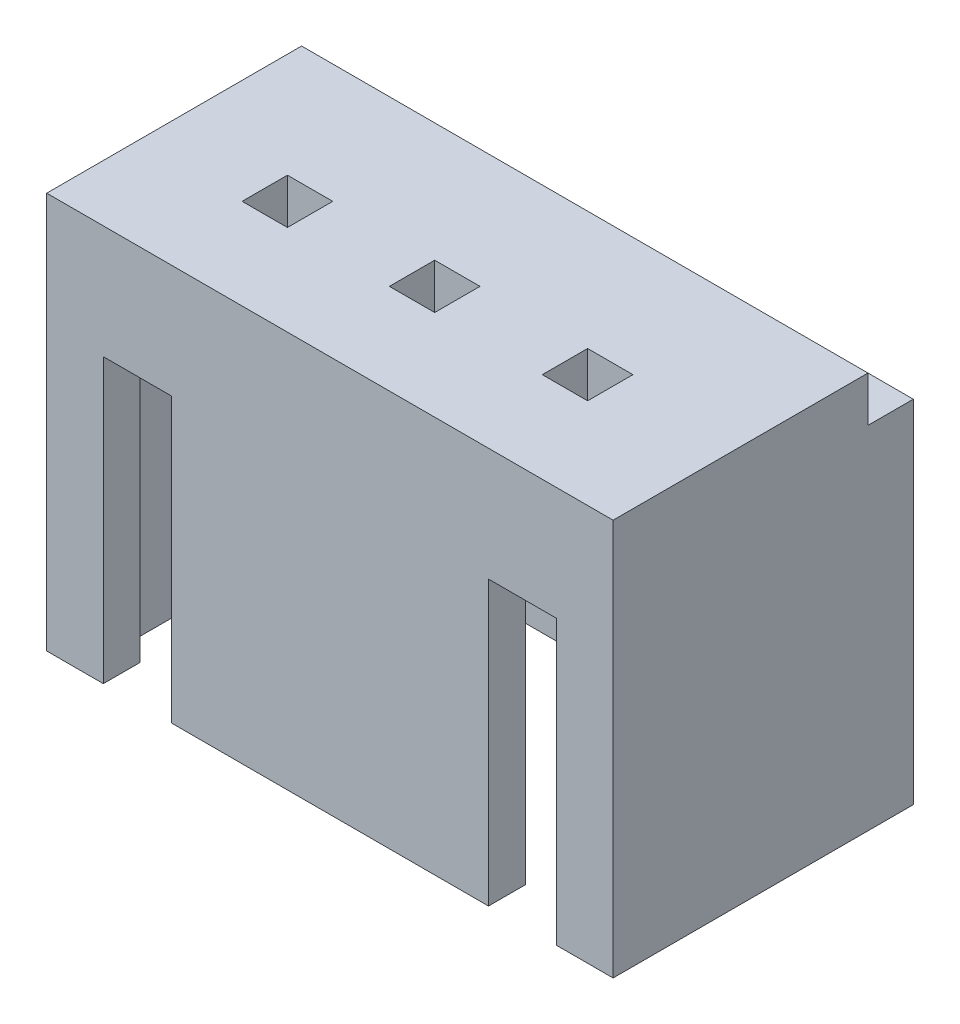
ISO-10303-21;
HEADER;
FILE_DESCRIPTION(('STEP AP214'),'2;1');
FILE_NAME('part.step','',(''),(''),'','','');
FILE_SCHEMA(('AUTOMOTIVE_DESIGN { 1 0 10303 214 1 1 1 1 }'));
ENDSEC;
DATA;
#1=APPLICATION_CONTEXT('core data for automotive mechanical design processes');
#2=APPLICATION_PROTOCOL_DEFINITION('international standard','automotive_design',2000,#1);
#3=PRODUCT_CONTEXT('',#1,'mechanical');
#4=PRODUCT('Part','Part','',(#3));
#5=PRODUCT_RELATED_PRODUCT_CATEGORY('part','',(#4));
#6=PRODUCT_DEFINITION_FORMATION('','',#4);
#7=PRODUCT_DEFINITION_CONTEXT('part definition',#1,'design');
#8=PRODUCT_DEFINITION('design','',#6,#7);
#9=PRODUCT_DEFINITION_SHAPE('','',#8);
#10=(LENGTH_UNIT() NAMED_UNIT(*) SI_UNIT(.MILLI.,.METRE.));
#11=(NAMED_UNIT(*) PLANE_ANGLE_UNIT() SI_UNIT($,.RADIAN.));
#12=(NAMED_UNIT(*) SI_UNIT($,.STERADIAN.) SOLID_ANGLE_UNIT());
#13=UNCERTAINTY_MEASURE_WITH_UNIT(LENGTH_MEASURE(1.E-05),#10,'distance_accuracy_value','');
#14=(GEOMETRIC_REPRESENTATION_CONTEXT(3) GLOBAL_UNCERTAINTY_ASSIGNED_CONTEXT((#13)) GLOBAL_UNIT_ASSIGNED_CONTEXT((#10,
#11,#12)) REPRESENTATION_CONTEXT('',''));
#15=CARTESIAN_POINT('',(0.,0.,0.));
#16=DIRECTION('',(0.,0.,1.));
#17=DIRECTION('',(1.,0.,0.));
#18=AXIS2_PLACEMENT_3D('',#15,#16,#17);
#19=CARTESIAN_POINT('',(5.,7.,2.65));
#20=DIRECTION('',(-1.,0.,0.));
#21=DIRECTION('',(0.,0.,1.));
#22=AXIS2_PLACEMENT_3D('',#19,#20,#21);
#23=PLANE('',#22);
#24=DIRECTION('',(0.,1.,0.));
#25=VECTOR('',#24,1.);
#26=CARTESIAN_POINT('',(5.,6.2,-1.85));
#27=LINE('',#26,#25);
#28=CARTESIAN_POINT('',(5.,6.2,-1.85));
#29=VERTEX_POINT('',#28);
#30=CARTESIAN_POINT('',(5.,7.,-1.85));
#31=VERTEX_POINT('',#30);
#32=EDGE_CURVE('E348',#29,#31,#27,.T.);
#33=ORIENTED_EDGE('',*,*,#32,.T.);
#34=DIRECTION('',(0.,0.,-1.));
#35=VECTOR('',#34,1.);
#36=CARTESIAN_POINT('',(5.,7.,2.65));
#37=LINE('',#36,#35);
#38=CARTESIAN_POINT('',(5.,7.,2.65));
#39=VERTEX_POINT('',#38);
#40=EDGE_CURVE('E424',#39,#31,#37,.T.);
#41=ORIENTED_EDGE('',*,*,#40,.F.);
#42=DIRECTION('',(0.,-1.,0.));
#43=VECTOR('',#42,1.);
#44=CARTESIAN_POINT('',(5.,7.,2.65));
#45=LINE('',#44,#43);
#46=CARTESIAN_POINT('',(5.,0.,2.65));
#47=VERTEX_POINT('',#46);
#48=EDGE_CURVE('E432',#39,#47,#45,.T.);
#49=ORIENTED_EDGE('',*,*,#48,.T.);
#50=DIRECTION('',(0.,0.,-1.));
#51=VECTOR('',#50,1.);
#52=CARTESIAN_POINT('',(5.,0.,2.65));
#53=LINE('',#52,#51);
#54=CARTESIAN_POINT('',(5.,0.,-2.65));
#55=VERTEX_POINT('',#54);
#56=EDGE_CURVE('E419',#47,#55,#53,.T.);
#57=ORIENTED_EDGE('',*,*,#56,.T.);
#58=DIRECTION('',(0.,-1.,0.));
#59=VECTOR('',#58,1.);
#60=CARTESIAN_POINT('',(5.,7.,-2.65));
#61=LINE('',#60,#59);
#62=CARTESIAN_POINT('',(5.,6.2,-2.65));
#63=VERTEX_POINT('',#62);
#64=EDGE_CURVE('E451',#63,#55,#61,.T.);
#65=ORIENTED_EDGE('',*,*,#64,.F.);
#66=DIRECTION('',(0.,0.,-1.));
#67=VECTOR('',#66,1.);
#68=CARTESIAN_POINT('',(5.,6.2,-1.85));
#69=LINE('',#68,#67);
#70=EDGE_CURVE('E336',#29,#63,#69,.T.);
#71=ORIENTED_EDGE('',*,*,#70,.F.);
#72=EDGE_LOOP('',(#33,#41,#49,#57,#65,#71));
#73=FACE_BOUND('',#72,.T.);
#74=ADVANCED_FACE('F33',(#73),#23,.F.);
#75=CARTESIAN_POINT('',(-5.,7.,-2.65));
#76=DIRECTION('',(0.,0.,1.));
#77=DIRECTION('',(1.,0.,0.));
#78=AXIS2_PLACEMENT_3D('',#75,#76,#77);
#79=PLANE('',#78);
#80=DIRECTION('',(-1.,0.,0.));
#81=VECTOR('',#80,1.);
#82=CARTESIAN_POINT('',(5.,6.2,-2.65));
#83=LINE('',#82,#81);
#84=CARTESIAN_POINT('',(-5.,6.2,-2.65));
#85=VERTEX_POINT('',#84);
#86=EDGE_CURVE('E338',#63,#85,#83,.T.);
#87=ORIENTED_EDGE('',*,*,#86,.F.);
#88=ORIENTED_EDGE('',*,*,#64,.T.);
#89=DIRECTION('',(-1.,0.,0.));
#90=VECTOR('',#89,1.);
#91=CARTESIAN_POINT('',(-5.,0.,-2.65));
#92=LINE('',#91,#90);
#93=CARTESIAN_POINT('',(-5.,0.,-2.65));
#94=VERTEX_POINT('',#93);
#95=EDGE_CURVE('E435',#55,#94,#92,.T.);
#96=ORIENTED_EDGE('',*,*,#95,.T.);
#97=DIRECTION('',(0.,-1.,0.));
#98=VECTOR('',#97,1.);
#99=CARTESIAN_POINT('',(-5.,7.,-2.65));
#100=LINE('',#99,#98);
#101=EDGE_CURVE('E449',#85,#94,#100,.T.);
#102=ORIENTED_EDGE('',*,*,#101,.F.);
#103=EDGE_LOOP('',(#87,#88,#96,#102));
#104=FACE_BOUND('',#103,.T.);
#105=ADVANCED_FACE('F514',(#104),#79,.F.);
#106=CARTESIAN_POINT('',(-5.,7.,2.65));
#107=DIRECTION('',(1.,0.,0.));
#108=DIRECTION('',(0.,0.,-1.));
#109=AXIS2_PLACEMENT_3D('',#106,#107,#108);
#110=PLANE('',#109);
#111=DIRECTION('',(0.,1.,0.));
#112=VECTOR('',#111,1.);
#113=CARTESIAN_POINT('',(-5.,6.2,-1.85));
#114=LINE('',#113,#112);
#115=CARTESIAN_POINT('',(-5.,6.2,-1.85));
#116=VERTEX_POINT('',#115);
#117=CARTESIAN_POINT('',(-5.,7.,-1.85));
#118=VERTEX_POINT('',#117);
#119=EDGE_CURVE('E345',#116,#118,#114,.T.);
#120=ORIENTED_EDGE('',*,*,#119,.F.);
#121=DIRECTION('',(0.,0.,-1.));
#122=VECTOR('',#121,1.);
#123=CARTESIAN_POINT('',(-5.,6.2,-1.85));
#124=LINE('',#123,#122);
#125=EDGE_CURVE('E340',#116,#85,#124,.T.);
#126=ORIENTED_EDGE('',*,*,#125,.T.);
#127=ORIENTED_EDGE('',*,*,#101,.T.);
#128=DIRECTION('',(0.,0.,1.));
#129=VECTOR('',#128,1.);
#130=CARTESIAN_POINT('',(-5.,0.,2.65));
#131=LINE('',#130,#129);
#132=CARTESIAN_POINT('',(-5.,0.,2.65));
#133=VERTEX_POINT('',#132);
#134=EDGE_CURVE('E438',#94,#133,#131,.T.);
#135=ORIENTED_EDGE('',*,*,#134,.T.);
#136=DIRECTION('',(0.,-1.,0.));
#137=VECTOR('',#136,1.);
#138=CARTESIAN_POINT('',(-5.,7.,2.65));
#139=LINE('',#138,#137);
#140=CARTESIAN_POINT('',(-5.,7.,2.65));
#141=VERTEX_POINT('',#140);
#142=EDGE_CURVE('E446',#141,#133,#139,.T.);
#143=ORIENTED_EDGE('',*,*,#142,.F.);
#144=DIRECTION('',(0.,0.,1.));
#145=VECTOR('',#144,1.);
#146=CARTESIAN_POINT('',(-5.,7.,2.65));
#147=LINE('',#146,#145);
#148=EDGE_CURVE('E427',#118,#141,#147,.T.);
#149=ORIENTED_EDGE('',*,*,#148,.F.);
#150=EDGE_LOOP('',(#120,#126,#127,#135,#143,#149));
#151=FACE_BOUND('',#150,.T.);
#152=ADVANCED_FACE('F519',(#151),#110,.F.);
#153=CARTESIAN_POINT('',(0.,7.,0.));
#154=DIRECTION('',(0.,-1.,0.));
#155=DIRECTION('',(0.,0.,-1.));
#156=AXIS2_PLACEMENT_3D('',#153,#154,#155);
#157=PLANE('',#156);
#158=DIRECTION('',(-1.,0.,0.));
#159=VECTOR('',#158,1.);
#160=CARTESIAN_POINT('',(-2.35000000000004,7.,0.249999999999994));
#161=LINE('',#160,#159);
#162=CARTESIAN_POINT('',(-2.35000000000004,7.,0.249999999999994));
#163=VERTEX_POINT('',#162);
#164=CARTESIAN_POINT('',(-3.15000000000003,7.,0.249999999999994));
#165=VERTEX_POINT('',#164);
#166=EDGE_CURVE('E280',#163,#165,#161,.T.);
#167=ORIENTED_EDGE('',*,*,#166,.F.);
#168=DIRECTION('',(0.,0.,-1.));
#169=VECTOR('',#168,1.);
#170=CARTESIAN_POINT('',(-2.35000000000004,7.,1.05));
#171=LINE('',#170,#169);
#172=CARTESIAN_POINT('',(-2.35000000000004,7.,1.05));
#173=VERTEX_POINT('',#172);
#174=EDGE_CURVE('E47',#173,#163,#171,.T.);
#175=ORIENTED_EDGE('',*,*,#174,.F.);
#176=DIRECTION('',(1.,0.,0.));
#177=VECTOR('',#176,1.);
#178=CARTESIAN_POINT('',(-2.35000000000004,7.,1.05));
#179=LINE('',#178,#177);
#180=CARTESIAN_POINT('',(-3.15000000000003,7.,1.05));
#181=VERTEX_POINT('',#180);
#182=EDGE_CURVE('E285',#181,#173,#179,.T.);
#183=ORIENTED_EDGE('',*,*,#182,.F.);
#184=DIRECTION('',(0.,0.,1.));
#185=VECTOR('',#184,1.);
#186=CARTESIAN_POINT('',(-3.15000000000003,7.,1.05));
#187=LINE('',#186,#185);
#188=EDGE_CURVE('E282',#165,#181,#187,.T.);
#189=ORIENTED_EDGE('',*,*,#188,.F.);
#190=EDGE_LOOP('',(#167,#175,#183,#189));
#191=FACE_BOUND('',#190,.T.);
#192=DIRECTION('',(-1.,0.,0.));
#193=VECTOR('',#192,1.);
#194=CARTESIAN_POINT('',(0.249999999999964,7.,0.250000000000012));
#195=LINE('',#194,#193);
#196=CARTESIAN_POINT('',(0.249999999999964,7.,0.250000000000012));
#197=VERTEX_POINT('',#196);
#198=CARTESIAN_POINT('',(-0.55000000000003,7.,0.250000000000012));
#199=VERTEX_POINT('',#198);
#200=EDGE_CURVE('E297',#197,#199,#195,.T.);
#201=ORIENTED_EDGE('',*,*,#200,.F.);
#202=DIRECTION('',(0.,0.,-1.));
#203=VECTOR('',#202,1.);
#204=CARTESIAN_POINT('',(0.249999999999964,7.,1.05000000000002));
#205=LINE('',#204,#203);
#206=CARTESIAN_POINT('',(0.249999999999964,7.,1.05000000000002));
#207=VERTEX_POINT('',#206);
#208=EDGE_CURVE('E291',#207,#197,#205,.T.);
#209=ORIENTED_EDGE('',*,*,#208,.F.);
#210=DIRECTION('',(1.,0.,0.));
#211=VECTOR('',#210,1.);
#212=CARTESIAN_POINT('',(0.249999999999964,7.,1.05000000000002));
#213=LINE('',#212,#211);
#214=CARTESIAN_POINT('',(-0.55000000000003,7.,1.05000000000002));
#215=VERTEX_POINT('',#214);
#216=EDGE_CURVE('E303',#215,#207,#213,.T.);
#217=ORIENTED_EDGE('',*,*,#216,.F.);
#218=DIRECTION('',(0.,0.,1.));
#219=VECTOR('',#218,1.);
#220=CARTESIAN_POINT('',(-0.55000000000003,7.,1.05000000000002));
#221=LINE('',#220,#219);
#222=EDGE_CURVE('E300',#199,#215,#221,.T.);
#223=ORIENTED_EDGE('',*,*,#222,.F.);
#224=EDGE_LOOP('',(#201,#209,#217,#223));
#225=FACE_BOUND('',#224,.T.);
#226=DIRECTION('',(-1.,0.,0.));
#227=VECTOR('',#226,1.);
#228=CARTESIAN_POINT('',(2.94999999999996,7.,0.250000000000031));
#229=LINE('',#228,#227);
#230=CARTESIAN_POINT('',(2.94999999999996,7.,0.250000000000031));
#231=VERTEX_POINT('',#230);
#232=CARTESIAN_POINT('',(2.14999999999997,7.,0.250000000000031));
#233=VERTEX_POINT('',#232);
#234=EDGE_CURVE('E317',#231,#233,#229,.T.);
#235=ORIENTED_EDGE('',*,*,#234,.F.);
#236=DIRECTION('',(0.,0.,-1.));
#237=VECTOR('',#236,1.);
#238=CARTESIAN_POINT('',(2.94999999999996,7.,1.05000000000004));
#239=LINE('',#238,#237);
#240=CARTESIAN_POINT('',(2.94999999999996,7.,1.05000000000004));
#241=VERTEX_POINT('',#240);
#242=EDGE_CURVE('E309',#241,#231,#239,.T.);
#243=ORIENTED_EDGE('',*,*,#242,.F.);
#244=DIRECTION('',(1.,0.,0.));
#245=VECTOR('',#244,1.);
#246=CARTESIAN_POINT('',(2.94999999999996,7.,1.05000000000004));
#247=LINE('',#246,#245);
#248=CARTESIAN_POINT('',(2.14999999999997,7.,1.05000000000004));
#249=VERTEX_POINT('',#248);
#250=EDGE_CURVE('E323',#249,#241,#247,.T.);
#251=ORIENTED_EDGE('',*,*,#250,.F.);
#252=DIRECTION('',(0.,0.,1.));
#253=VECTOR('',#252,1.);
#254=CARTESIAN_POINT('',(2.14999999999997,7.,1.05000000000004));
#255=LINE('',#254,#253);
#256=EDGE_CURVE('E320',#233,#249,#255,.T.);
#257=ORIENTED_EDGE('',*,*,#256,.F.);
#258=EDGE_LOOP('',(#235,#243,#251,#257));
#259=FACE_BOUND('',#258,.T.);
#260=DIRECTION('',(-1.,0.,0.));
#261=VECTOR('',#260,1.);
#262=CARTESIAN_POINT('',(5.,7.,-1.85));
#263=LINE('',#262,#261);
#264=EDGE_CURVE('E329',#31,#118,#263,.T.);
#265=ORIENTED_EDGE('',*,*,#264,.T.);
#266=ORIENTED_EDGE('',*,*,#148,.T.);
#267=DIRECTION('',(1.,0.,0.));
#268=VECTOR('',#267,1.);
#269=CARTESIAN_POINT('',(-5.,7.,2.65));
#270=LINE('',#269,#268);
#271=EDGE_CURVE('E430',#141,#39,#270,.T.);
#272=ORIENTED_EDGE('',*,*,#271,.T.);
#273=ORIENTED_EDGE('',*,*,#40,.T.);
#274=EDGE_LOOP('',(#265,#266,#272,#273));
#275=FACE_BOUND('',#274,.T.);
#276=ADVANCED_FACE('F496',(#191,#225,#259,#275),#157,.F.);
#277=CARTESIAN_POINT('',(0.,0.,0.));
#278=DIRECTION('',(0.,-1.,0.));
#279=DIRECTION('',(0.,0.,-1.));
#280=AXIS2_PLACEMENT_3D('',#277,#278,#279);
#281=PLANE('',#280);
#282=DIRECTION('',(0.,0.,1.));
#283=VECTOR('',#282,1.);
#284=CARTESIAN_POINT('',(2.8,0.,-1.35));
#285=LINE('',#284,#283);
#286=CARTESIAN_POINT('',(2.8,0.,2.));
#287=VERTEX_POINT('',#286);
#288=CARTESIAN_POINT('',(2.8,0.,2.65));
#289=VERTEX_POINT('',#288);
#290=EDGE_CURVE('E360',#287,#289,#285,.T.);
#291=ORIENTED_EDGE('',*,*,#290,.T.);
#292=DIRECTION('',(1.,0.,0.));
#293=VECTOR('',#292,1.);
#294=CARTESIAN_POINT('',(-5.,0.,2.65));
#295=LINE('',#294,#293);
#296=CARTESIAN_POINT('',(-2.8,0.,2.65));
#297=VERTEX_POINT('',#296);
#298=EDGE_CURVE('E443',#297,#289,#295,.T.);
#299=ORIENTED_EDGE('',*,*,#298,.F.);
#300=DIRECTION('',(0.,0.,1.));
#301=VECTOR('',#300,1.);
#302=CARTESIAN_POINT('',(-2.8,0.,-1.35));
#303=LINE('',#302,#301);
#304=CARTESIAN_POINT('',(-2.8,0.,2.));
#305=VERTEX_POINT('',#304);
#306=EDGE_CURVE('E389',#305,#297,#303,.T.);
#307=ORIENTED_EDGE('',*,*,#306,.F.);
#308=DIRECTION('',(-1.,0.,0.));
#309=VECTOR('',#308,1.);
#310=CARTESIAN_POINT('',(-4.4,0.,2.));
#311=LINE('',#310,#309);
#312=EDGE_CURVE('E416',#287,#305,#311,.T.);
#313=ORIENTED_EDGE('',*,*,#312,.F.);
#314=EDGE_LOOP('',(#291,#299,#307,#313));
#315=FACE_BOUND('',#314,.T.);
#316=ADVANCED_FACE('F594',(#315),#281,.T.);
#317=CARTESIAN_POINT('',(-4.4,5.,2.));
#318=DIRECTION('',(0.,0.,1.));
#319=DIRECTION('',(1.,0.,0.));
#320=AXIS2_PLACEMENT_3D('',#317,#318,#319);
#321=PLANE('',#320);
#322=DIRECTION('',(-1.,0.,0.));
#323=VECTOR('',#322,1.);
#324=CARTESIAN_POINT('',(-4.4,5.,2.));
#325=LINE('',#324,#323);
#326=CARTESIAN_POINT('',(2.8,5.,2.));
#327=VERTEX_POINT('',#326);
#328=CARTESIAN_POINT('',(-2.8,5.,2.));
#329=VERTEX_POINT('',#328);
#330=EDGE_CURVE('E407',#327,#329,#325,.T.);
#331=ORIENTED_EDGE('',*,*,#330,.F.);
#332=DIRECTION('',(0.,-1.,0.));
#333=VECTOR('',#332,1.);
#334=CARTESIAN_POINT('',(2.8,5.,2.));
#335=LINE('',#334,#333);
#336=EDGE_CURVE('E372',#327,#287,#335,.T.);
#337=ORIENTED_EDGE('',*,*,#336,.T.);
#338=ORIENTED_EDGE('',*,*,#312,.T.);
#339=DIRECTION('',(0.,1.,0.));
#340=VECTOR('',#339,1.);
#341=CARTESIAN_POINT('',(-2.8,5.,2.));
#342=LINE('',#341,#340);
#343=EDGE_CURVE('E386',#305,#329,#342,.T.);
#344=ORIENTED_EDGE('',*,*,#343,.T.);
#345=EDGE_LOOP('',(#331,#337,#338,#344));
#346=FACE_BOUND('',#345,.T.);
#347=ADVANCED_FACE('F587',(#346),#321,.F.);
#348=CARTESIAN_POINT('',(-4.,5.,2.));
#349=VERTEX_POINT('',#348);
#350=CARTESIAN_POINT('',(-4.4,5.,2.));
#351=VERTEX_POINT('',#350);
#352=EDGE_CURVE('E401',#349,#351,#325,.T.);
#353=ORIENTED_EDGE('',*,*,#352,.F.);
#354=DIRECTION('',(0.,-1.,0.));
#355=VECTOR('',#354,1.);
#356=CARTESIAN_POINT('',(-4.,5.,2.));
#357=LINE('',#356,#355);
#358=CARTESIAN_POINT('',(-4.,0.,2.));
#359=VERTEX_POINT('',#358);
#360=EDGE_CURVE('E395',#349,#359,#357,.T.);
#361=ORIENTED_EDGE('',*,*,#360,.T.);
#362=CARTESIAN_POINT('',(-4.4,0.,2.));
#363=VERTEX_POINT('',#362);
#364=EDGE_CURVE('E412',#359,#363,#311,.T.);
#365=ORIENTED_EDGE('',*,*,#364,.T.);
#366=DIRECTION('',(0.,-1.,0.));
#367=VECTOR('',#366,1.);
#368=CARTESIAN_POINT('',(-4.4,5.,2.));
#369=LINE('',#368,#367);
#370=EDGE_CURVE('E255',#351,#363,#369,.T.);
#371=ORIENTED_EDGE('',*,*,#370,.F.);
#372=EDGE_LOOP('',(#353,#361,#365,#371));
#373=FACE_BOUND('',#372,.T.);
#374=ADVANCED_FACE('F588',(#373),#321,.F.);
#375=CARTESIAN_POINT('',(-5.,7.,2.65));
#376=DIRECTION('',(0.,0.,-1.));
#377=DIRECTION('',(-1.,0.,0.));
#378=AXIS2_PLACEMENT_3D('',#375,#376,#377);
#379=PLANE('',#378);
#380=ORIENTED_EDGE('',*,*,#298,.T.);
#381=DIRECTION('',(0.,-1.,0.));
#382=VECTOR('',#381,1.);
#383=CARTESIAN_POINT('',(2.8,0.,2.65));
#384=LINE('',#383,#382);
#385=CARTESIAN_POINT('',(2.8,5.,2.65));
#386=VERTEX_POINT('',#385);
#387=EDGE_CURVE('E351',#386,#289,#384,.T.);
#388=ORIENTED_EDGE('',*,*,#387,.F.);
#389=DIRECTION('',(-1.,0.,0.));
#390=VECTOR('',#389,1.);
#391=CARTESIAN_POINT('',(2.8,5.,2.65));
#392=LINE('',#391,#390);
#393=CARTESIAN_POINT('',(4.,5.,2.65));
#394=VERTEX_POINT('',#393);
#395=EDGE_CURVE('E357',#394,#386,#392,.T.);
#396=ORIENTED_EDGE('',*,*,#395,.F.);
#397=DIRECTION('',(0.,1.,0.));
#398=VECTOR('',#397,1.);
#399=CARTESIAN_POINT('',(4.,0.,2.65));
#400=LINE('',#399,#398);
#401=CARTESIAN_POINT('',(4.,0.,2.65));
#402=VERTEX_POINT('',#401);
#403=EDGE_CURVE('E354',#402,#394,#400,.T.);
#404=ORIENTED_EDGE('',*,*,#403,.F.);
#405=EDGE_CURVE('E440',#402,#47,#295,.T.);
#406=ORIENTED_EDGE('',*,*,#405,.T.);
#407=ORIENTED_EDGE('',*,*,#48,.F.);
#408=ORIENTED_EDGE('',*,*,#271,.F.);
#409=ORIENTED_EDGE('',*,*,#142,.T.);
#410=CARTESIAN_POINT('',(-4.,0.,2.65));
#411=VERTEX_POINT('',#410);
#412=EDGE_CURVE('E428',#133,#411,#295,.T.);
#413=ORIENTED_EDGE('',*,*,#412,.T.);
#414=DIRECTION('',(0.,-1.,0.));
#415=VECTOR('',#414,1.);
#416=CARTESIAN_POINT('',(-4.,0.,2.65));
#417=LINE('',#416,#415);
#418=CARTESIAN_POINT('',(-4.,5.,2.65));
#419=VERTEX_POINT('',#418);
#420=EDGE_CURVE('E375',#419,#411,#417,.T.);
#421=ORIENTED_EDGE('',*,*,#420,.F.);
#422=DIRECTION('',(-1.,0.,0.));
#423=VECTOR('',#422,1.);
#424=CARTESIAN_POINT('',(-4.,5.,2.65));
#425=LINE('',#424,#423);
#426=CARTESIAN_POINT('',(-2.8,5.,2.65));
#427=VERTEX_POINT('',#426);
#428=EDGE_CURVE('E380',#427,#419,#425,.T.);
#429=ORIENTED_EDGE('',*,*,#428,.F.);
#430=DIRECTION('',(0.,1.,0.));
#431=VECTOR('',#430,1.);
#432=CARTESIAN_POINT('',(-2.8,0.,2.65));
#433=LINE('',#432,#431);
#434=EDGE_CURVE('E377',#297,#427,#433,.T.);
#435=ORIENTED_EDGE('',*,*,#434,.F.);
#436=EDGE_LOOP('',(#380,#388,#396,#404,#406,#407,#408,#409,#413,#421,#429,#435));
#437=FACE_BOUND('',#436,.T.);
#438=ADVANCED_FACE('F533',(#437),#379,.F.);
#439=DIRECTION('',(0.,0.,1.));
#440=VECTOR('',#439,1.);
#441=CARTESIAN_POINT('',(4.,0.,-1.35));
#442=LINE('',#441,#440);
#443=CARTESIAN_POINT('',(4.,0.,2.));
#444=VERTEX_POINT('',#443);
#445=EDGE_CURVE('E366',#444,#402,#442,.T.);
#446=ORIENTED_EDGE('',*,*,#445,.F.);
#447=CARTESIAN_POINT('',(4.4,0.,2.));
#448=VERTEX_POINT('',#447);
#449=EDGE_CURVE('E413',#448,#444,#311,.T.);
#450=ORIENTED_EDGE('',*,*,#449,.F.);
#451=DIRECTION('',(0.,0.,1.));
#452=VECTOR('',#451,1.);
#453=CARTESIAN_POINT('',(4.4,0.,-2.));
#454=LINE('',#453,#452);
#455=CARTESIAN_POINT('',(4.4,0.,-2.));
#456=VERTEX_POINT('',#455);
#457=EDGE_CURVE('E398',#456,#448,#454,.T.);
#458=ORIENTED_EDGE('',*,*,#457,.F.);
#459=DIRECTION('',(1.,0.,0.));
#460=VECTOR('',#459,1.);
#461=CARTESIAN_POINT('',(-4.4,0.,-2.));
#462=LINE('',#461,#460);
#463=CARTESIAN_POINT('',(-4.4,0.,-2.));
#464=VERTEX_POINT('',#463);
#465=EDGE_CURVE('E402',#464,#456,#462,.T.);
#466=ORIENTED_EDGE('',*,*,#465,.F.);
#467=DIRECTION('',(0.,0.,-1.));
#468=VECTOR('',#467,1.);
#469=CARTESIAN_POINT('',(-4.4,0.,-2.));
#470=LINE('',#469,#468);
#471=EDGE_CURVE('E250',#363,#464,#470,.T.);
#472=ORIENTED_EDGE('',*,*,#471,.F.);
#473=ORIENTED_EDGE('',*,*,#364,.F.);
#474=DIRECTION('',(0.,0.,1.));
#475=VECTOR('',#474,1.);
#476=CARTESIAN_POINT('',(-4.,0.,-1.35));
#477=LINE('',#476,#475);
#478=EDGE_CURVE('E383',#359,#411,#477,.T.);
#479=ORIENTED_EDGE('',*,*,#478,.T.);
#480=ORIENTED_EDGE('',*,*,#412,.F.);
#481=ORIENTED_EDGE('',*,*,#134,.F.);
#482=ORIENTED_EDGE('',*,*,#95,.F.);
#483=ORIENTED_EDGE('',*,*,#56,.F.);
#484=ORIENTED_EDGE('',*,*,#405,.F.);
#485=EDGE_LOOP('',(#446,#450,#458,#466,#472,#473,#479,#480,#481,#482,#483,#484));
#486=FACE_BOUND('',#485,.T.);
#487=ADVANCED_FACE('F540',(#486),#281,.T.);
#488=CARTESIAN_POINT('',(4.4,5.,-2.));
#489=DIRECTION('',(1.,0.,0.));
#490=DIRECTION('',(0.,0.,-1.));
#491=AXIS2_PLACEMENT_3D('',#488,#489,#490);
#492=PLANE('',#491);
#493=ORIENTED_EDGE('',*,*,#457,.T.);
#494=DIRECTION('',(0.,-1.,0.));
#495=VECTOR('',#494,1.);
#496=CARTESIAN_POINT('',(4.4,5.,2.));
#497=LINE('',#496,#495);
#498=CARTESIAN_POINT('',(4.4,5.,2.));
#499=VERTEX_POINT('',#498);
#500=EDGE_CURVE('E410',#499,#448,#497,.T.);
#501=ORIENTED_EDGE('',*,*,#500,.F.);
#502=DIRECTION('',(0.,0.,1.));
#503=VECTOR('',#502,1.);
#504=CARTESIAN_POINT('',(4.4,5.,-2.));
#505=LINE('',#504,#503);
#506=CARTESIAN_POINT('',(4.4,5.,-1.));
#507=VERTEX_POINT('',#506);
#508=EDGE_CURVE('E399',#507,#499,#505,.T.);
#509=ORIENTED_EDGE('',*,*,#508,.F.);
#510=DIRECTION('',(0.,-1.,0.));
#511=VECTOR('',#510,1.);
#512=CARTESIAN_POINT('',(4.4,5.3,-1.));
#513=LINE('',#512,#511);
#514=CARTESIAN_POINT('',(4.4,5.3,-1.));
#515=VERTEX_POINT('',#514);
#516=EDGE_CURVE('E274',#515,#507,#513,.T.);
#517=ORIENTED_EDGE('',*,*,#516,.F.);
#518=DIRECTION('',(0.,0.,1.));
#519=VECTOR('',#518,1.);
#520=CARTESIAN_POINT('',(4.4,5.3,-2.));
#521=LINE('',#520,#519);
#522=CARTESIAN_POINT('',(4.4,5.3,-2.));
#523=VERTEX_POINT('',#522);
#524=EDGE_CURVE('E263',#523,#515,#521,.T.);
#525=ORIENTED_EDGE('',*,*,#524,.F.);
#526=DIRECTION('',(0.,-1.,0.));
#527=VECTOR('',#526,1.);
#528=CARTESIAN_POINT('',(4.4,5.,-2.));
#529=LINE('',#528,#527);
#530=EDGE_CURVE('E254',#523,#456,#529,.T.);
#531=ORIENTED_EDGE('',*,*,#530,.T.);
#532=EDGE_LOOP('',(#493,#501,#509,#517,#525,#531));
#533=FACE_BOUND('',#532,.T.);
#534=ADVANCED_FACE('F581',(#533),#492,.F.);
#535=CARTESIAN_POINT('',(-4.4,5.,-2.));
#536=DIRECTION('',(0.,0.,-1.));
#537=DIRECTION('',(-1.,0.,0.));
#538=AXIS2_PLACEMENT_3D('',#535,#536,#537);
#539=PLANE('',#538);
#540=ORIENTED_EDGE('',*,*,#465,.T.);
#541=ORIENTED_EDGE('',*,*,#530,.F.);
#542=DIRECTION('',(1.,0.,0.));
#543=VECTOR('',#542,1.);
#544=CARTESIAN_POINT('',(-4.4,5.3,-2.));
#545=LINE('',#544,#543);
#546=CARTESIAN_POINT('',(-4.4,5.3,-2.));
#547=VERTEX_POINT('',#546);
#548=EDGE_CURVE('E258',#547,#523,#545,.T.);
#549=ORIENTED_EDGE('',*,*,#548,.F.);
#550=DIRECTION('',(0.,-1.,0.));
#551=VECTOR('',#550,1.);
#552=CARTESIAN_POINT('',(-4.4,5.,-2.));
#553=LINE('',#552,#551);
#554=EDGE_CURVE('E242',#547,#464,#553,.T.);
#555=ORIENTED_EDGE('',*,*,#554,.T.);
#556=EDGE_LOOP('',(#540,#541,#549,#555));
#557=FACE_BOUND('',#556,.T.);
#558=ADVANCED_FACE('F259',(#557),#539,.F.);
#559=CARTESIAN_POINT('',(-4.4,5.,-2.));
#560=DIRECTION('',(-1.,0.,0.));
#561=DIRECTION('',(0.,0.,1.));
#562=AXIS2_PLACEMENT_3D('',#559,#560,#561);
#563=PLANE('',#562);
#564=ORIENTED_EDGE('',*,*,#471,.T.);
#565=ORIENTED_EDGE('',*,*,#554,.F.);
#566=DIRECTION('',(0.,0.,-1.));
#567=VECTOR('',#566,1.);
#568=CARTESIAN_POINT('',(-4.4,5.3,-2.));
#569=LINE('',#568,#567);
#570=CARTESIAN_POINT('',(-4.4,5.3,-1.));
#571=VERTEX_POINT('',#570);
#572=EDGE_CURVE('E246',#571,#547,#569,.T.);
#573=ORIENTED_EDGE('',*,*,#572,.F.);
#574=DIRECTION('',(0.,-1.,0.));
#575=VECTOR('',#574,1.);
#576=CARTESIAN_POINT('',(-4.4,5.3,-1.));
#577=LINE('',#576,#575);
#578=CARTESIAN_POINT('',(-4.4,5.,-1.));
#579=VERTEX_POINT('',#578);
#580=EDGE_CURVE('E276',#571,#579,#577,.T.);
#581=ORIENTED_EDGE('',*,*,#580,.T.);
#582=DIRECTION('',(0.,0.,-1.));
#583=VECTOR('',#582,1.);
#584=CARTESIAN_POINT('',(-4.4,5.,-2.));
#585=LINE('',#584,#583);
#586=EDGE_CURVE('E406',#351,#579,#585,.T.);
#587=ORIENTED_EDGE('',*,*,#586,.F.);
#588=ORIENTED_EDGE('',*,*,#370,.T.);
#589=EDGE_LOOP('',(#564,#565,#573,#581,#587,#588));
#590=FACE_BOUND('',#589,.T.);
#591=ADVANCED_FACE('F244',(#590),#563,.F.);
#592=ORIENTED_EDGE('',*,*,#449,.T.);
#593=DIRECTION('',(0.,1.,0.));
#594=VECTOR('',#593,1.);
#595=CARTESIAN_POINT('',(4.,5.,2.));
#596=LINE('',#595,#594);
#597=CARTESIAN_POINT('',(4.,5.,2.));
#598=VERTEX_POINT('',#597);
#599=EDGE_CURVE('E363',#444,#598,#596,.T.);
#600=ORIENTED_EDGE('',*,*,#599,.T.);
#601=EDGE_CURVE('E403',#499,#598,#325,.T.);
#602=ORIENTED_EDGE('',*,*,#601,.F.);
#603=ORIENTED_EDGE('',*,*,#500,.T.);
#604=EDGE_LOOP('',(#592,#600,#602,#603));
#605=FACE_BOUND('',#604,.T.);
#606=ADVANCED_FACE('F578',(#605),#321,.F.);
#607=CARTESIAN_POINT('',(0.,5.,0.));
#608=DIRECTION('',(0.,1.,0.));
#609=DIRECTION('',(0.,0.,1.));
#610=AXIS2_PLACEMENT_3D('',#607,#608,#609);
#611=PLANE('',#610);
#612=DIRECTION('',(1.,0.,0.));
#613=VECTOR('',#612,1.);
#614=CARTESIAN_POINT('',(0.,5.,1.05));
#615=LINE('',#614,#613);
#616=CARTESIAN_POINT('',(-3.15000000000003,5.,1.05));
#617=VERTEX_POINT('',#616);
#618=CARTESIAN_POINT('',(-2.35000000000004,5.,1.05));
#619=VERTEX_POINT('',#618);
#620=EDGE_CURVE('E40',#617,#619,#615,.T.);
#621=ORIENTED_EDGE('',*,*,#620,.T.);
#622=DIRECTION('',(0.,0.,-1.));
#623=VECTOR('',#622,1.);
#624=CARTESIAN_POINT('',(-2.35000000000004,5.,0.));
#625=LINE('',#624,#623);
#626=CARTESIAN_POINT('',(-2.35000000000004,5.,0.249999999999994));
#627=VERTEX_POINT('',#626);
#628=EDGE_CURVE('E11',#619,#627,#625,.T.);
#629=ORIENTED_EDGE('',*,*,#628,.T.);
#630=DIRECTION('',(-1.,0.,0.));
#631=VECTOR('',#630,1.);
#632=CARTESIAN_POINT('',(0.,5.,0.249999999999994));
#633=LINE('',#632,#631);
#634=CARTESIAN_POINT('',(-3.15000000000003,5.,0.249999999999994));
#635=VERTEX_POINT('',#634);
#636=EDGE_CURVE('E477',#627,#635,#633,.T.);
#637=ORIENTED_EDGE('',*,*,#636,.T.);
#638=DIRECTION('',(0.,0.,1.));
#639=VECTOR('',#638,1.);
#640=CARTESIAN_POINT('',(-3.15000000000003,5.,0.));
#641=LINE('',#640,#639);
#642=EDGE_CURVE('E480',#635,#617,#641,.T.);
#643=ORIENTED_EDGE('',*,*,#642,.T.);
#644=EDGE_LOOP('',(#621,#629,#637,#643));
#645=FACE_BOUND('',#644,.T.);
#646=DIRECTION('',(1.,0.,0.));
#647=VECTOR('',#646,1.);
#648=CARTESIAN_POINT('',(0.,5.,1.05000000000002));
#649=LINE('',#648,#647);
#650=CARTESIAN_POINT('',(-0.55000000000003,5.,1.05000000000002));
#651=VERTEX_POINT('',#650);
#652=CARTESIAN_POINT('',(0.249999999999964,5.,1.05000000000002));
#653=VERTEX_POINT('',#652);
#654=EDGE_CURVE('E471',#651,#653,#649,.T.);
#655=ORIENTED_EDGE('',*,*,#654,.T.);
#656=DIRECTION('',(0.,0.,-1.));
#657=VECTOR('',#656,1.);
#658=CARTESIAN_POINT('',(0.249999999999964,5.,0.));
#659=LINE('',#658,#657);
#660=CARTESIAN_POINT('',(0.249999999999964,5.,0.250000000000012));
#661=VERTEX_POINT('',#660);
#662=EDGE_CURVE('E474',#653,#661,#659,.T.);
#663=ORIENTED_EDGE('',*,*,#662,.T.);
#664=DIRECTION('',(-1.,0.,0.));
#665=VECTOR('',#664,1.);
#666=CARTESIAN_POINT('',(0.,5.,0.250000000000012));
#667=LINE('',#666,#665);
#668=CARTESIAN_POINT('',(-0.55000000000003,5.,0.250000000000012));
#669=VERTEX_POINT('',#668);
#670=EDGE_CURVE('E465',#661,#669,#667,.T.);
#671=ORIENTED_EDGE('',*,*,#670,.T.);
#672=DIRECTION('',(0.,0.,1.));
#673=VECTOR('',#672,1.);
#674=CARTESIAN_POINT('',(-0.55000000000003,5.,0.));
#675=LINE('',#674,#673);
#676=EDGE_CURVE('E468',#669,#651,#675,.T.);
#677=ORIENTED_EDGE('',*,*,#676,.T.);
#678=EDGE_LOOP('',(#655,#663,#671,#677));
#679=FACE_BOUND('',#678,.T.);
#680=DIRECTION('',(1.,0.,0.));
#681=VECTOR('',#680,1.);
#682=CARTESIAN_POINT('',(0.,5.,1.05000000000004));
#683=LINE('',#682,#681);
#684=CARTESIAN_POINT('',(2.14999999999997,5.,1.05000000000004));
#685=VERTEX_POINT('',#684);
#686=CARTESIAN_POINT('',(2.94999999999996,5.,1.05000000000004));
#687=VERTEX_POINT('',#686);
#688=EDGE_CURVE('E459',#685,#687,#683,.T.);
#689=ORIENTED_EDGE('',*,*,#688,.T.);
#690=DIRECTION('',(0.,0.,-1.));
#691=VECTOR('',#690,1.);
#692=CARTESIAN_POINT('',(2.94999999999996,5.,0.));
#693=LINE('',#692,#691);
#694=CARTESIAN_POINT('',(2.94999999999996,5.,0.250000000000031));
#695=VERTEX_POINT('',#694);
#696=EDGE_CURVE('E462',#687,#695,#693,.T.);
#697=ORIENTED_EDGE('',*,*,#696,.T.);
#698=DIRECTION('',(-1.,0.,0.));
#699=VECTOR('',#698,1.);
#700=CARTESIAN_POINT('',(0.,5.,0.250000000000031));
#701=LINE('',#700,#699);
#702=CARTESIAN_POINT('',(2.14999999999997,5.,0.250000000000031));
#703=VERTEX_POINT('',#702);
#704=EDGE_CURVE('E453',#695,#703,#701,.T.);
#705=ORIENTED_EDGE('',*,*,#704,.T.);
#706=DIRECTION('',(0.,0.,1.));
#707=VECTOR('',#706,1.);
#708=CARTESIAN_POINT('',(2.14999999999997,5.,0.));
#709=LINE('',#708,#707);
#710=EDGE_CURVE('E456',#703,#685,#709,.T.);
#711=ORIENTED_EDGE('',*,*,#710,.T.);
#712=EDGE_LOOP('',(#689,#697,#705,#711));
#713=FACE_BOUND('',#712,.T.);
#714=ORIENTED_EDGE('',*,*,#586,.T.);
#715=DIRECTION('',(-1.,0.,0.));
#716=VECTOR('',#715,1.);
#717=CARTESIAN_POINT('',(-4.4,5.,-1.));
#718=LINE('',#717,#716);
#719=EDGE_CURVE('E268',#507,#579,#718,.T.);
#720=ORIENTED_EDGE('',*,*,#719,.F.);
#721=ORIENTED_EDGE('',*,*,#508,.T.);
#722=ORIENTED_EDGE('',*,*,#601,.T.);
#723=DIRECTION('',(0.,0.,1.));
#724=VECTOR('',#723,1.);
#725=CARTESIAN_POINT('',(4.,5.,-1.35));
#726=LINE('',#725,#724);
#727=EDGE_CURVE('E364',#598,#394,#726,.T.);
#728=ORIENTED_EDGE('',*,*,#727,.T.);
#729=ORIENTED_EDGE('',*,*,#395,.T.);
#730=DIRECTION('',(0.,0.,1.));
#731=VECTOR('',#730,1.);
#732=CARTESIAN_POINT('',(2.8,5.,-1.35));
#733=LINE('',#732,#731);
#734=EDGE_CURVE('E361',#327,#386,#733,.T.);
#735=ORIENTED_EDGE('',*,*,#734,.F.);
#736=ORIENTED_EDGE('',*,*,#330,.T.);
#737=DIRECTION('',(0.,0.,1.));
#738=VECTOR('',#737,1.);
#739=CARTESIAN_POINT('',(-2.8,5.,-1.35));
#740=LINE('',#739,#738);
#741=EDGE_CURVE('E387',#329,#427,#740,.T.);
#742=ORIENTED_EDGE('',*,*,#741,.T.);
#743=ORIENTED_EDGE('',*,*,#428,.T.);
#744=DIRECTION('',(0.,0.,1.));
#745=VECTOR('',#744,1.);
#746=CARTESIAN_POINT('',(-4.,5.,-1.35));
#747=LINE('',#746,#745);
#748=EDGE_CURVE('E384',#349,#419,#747,.T.);
#749=ORIENTED_EDGE('',*,*,#748,.F.);
#750=ORIENTED_EDGE('',*,*,#352,.T.);
#751=EDGE_LOOP('',(#714,#720,#721,#722,#728,#729,#735,#736,#742,#743,#749,#750));
#752=FACE_BOUND('',#751,.T.);
#753=ADVANCED_FACE('F484',(#645,#679,#713,#752),#611,.F.);
#754=CARTESIAN_POINT('',(-4.,0.,-1.35));
#755=DIRECTION('',(-1.,0.,0.));
#756=DIRECTION('',(0.,0.,1.));
#757=AXIS2_PLACEMENT_3D('',#754,#755,#756);
#758=PLANE('',#757);
#759=ORIENTED_EDGE('',*,*,#748,.T.);
#760=ORIENTED_EDGE('',*,*,#420,.T.);
#761=ORIENTED_EDGE('',*,*,#478,.F.);
#762=ORIENTED_EDGE('',*,*,#360,.F.);
#763=EDGE_LOOP('',(#759,#760,#761,#762));
#764=FACE_BOUND('',#763,.T.);
#765=ADVANCED_FACE('F571',(#764),#758,.F.);
#766=CARTESIAN_POINT('',(-2.8,0.,-1.35));
#767=DIRECTION('',(1.,0.,0.));
#768=DIRECTION('',(0.,0.,-1.));
#769=AXIS2_PLACEMENT_3D('',#766,#767,#768);
#770=PLANE('',#769);
#771=ORIENTED_EDGE('',*,*,#306,.T.);
#772=ORIENTED_EDGE('',*,*,#434,.T.);
#773=ORIENTED_EDGE('',*,*,#741,.F.);
#774=ORIENTED_EDGE('',*,*,#343,.F.);
#775=EDGE_LOOP('',(#771,#772,#773,#774));
#776=FACE_BOUND('',#775,.T.);
#777=ADVANCED_FACE('F567',(#776),#770,.F.);
#778=CARTESIAN_POINT('',(2.8,0.,-1.35));
#779=DIRECTION('',(-1.,0.,0.));
#780=DIRECTION('',(0.,0.,1.));
#781=AXIS2_PLACEMENT_3D('',#778,#779,#780);
#782=PLANE('',#781);
#783=ORIENTED_EDGE('',*,*,#734,.T.);
#784=ORIENTED_EDGE('',*,*,#387,.T.);
#785=ORIENTED_EDGE('',*,*,#290,.F.);
#786=ORIENTED_EDGE('',*,*,#336,.F.);
#787=EDGE_LOOP('',(#783,#784,#785,#786));
#788=FACE_BOUND('',#787,.T.);
#789=ADVANCED_FACE('F560',(#788),#782,.F.);
#790=CARTESIAN_POINT('',(4.,0.,-1.35));
#791=DIRECTION('',(1.,0.,0.));
#792=DIRECTION('',(0.,0.,-1.));
#793=AXIS2_PLACEMENT_3D('',#790,#791,#792);
#794=PLANE('',#793);
#795=ORIENTED_EDGE('',*,*,#445,.T.);
#796=ORIENTED_EDGE('',*,*,#403,.T.);
#797=ORIENTED_EDGE('',*,*,#727,.F.);
#798=ORIENTED_EDGE('',*,*,#599,.F.);
#799=EDGE_LOOP('',(#795,#796,#797,#798));
#800=FACE_BOUND('',#799,.T.);
#801=ADVANCED_FACE('F552',(#800),#794,.F.);
#802=CARTESIAN_POINT('',(5.,6.2,-1.85));
#803=DIRECTION('',(0.,0.,-1.));
#804=DIRECTION('',(-1.,0.,0.));
#805=AXIS2_PLACEMENT_3D('',#802,#803,#804);
#806=PLANE('',#805);
#807=ORIENTED_EDGE('',*,*,#264,.F.);
#808=ORIENTED_EDGE('',*,*,#32,.F.);
#809=DIRECTION('',(-1.,0.,0.));
#810=VECTOR('',#809,1.);
#811=CARTESIAN_POINT('',(5.,6.2,-1.85));
#812=LINE('',#811,#810);
#813=EDGE_CURVE('E343',#29,#116,#812,.T.);
#814=ORIENTED_EDGE('',*,*,#813,.T.);
#815=ORIENTED_EDGE('',*,*,#119,.T.);
#816=EDGE_LOOP('',(#807,#808,#814,#815));
#817=FACE_BOUND('',#816,.T.);
#818=ADVANCED_FACE('F550',(#817),#806,.T.);
#819=CARTESIAN_POINT('',(0.,6.2,0.));
#820=DIRECTION('',(0.,1.,0.));
#821=DIRECTION('',(0.,0.,1.));
#822=AXIS2_PLACEMENT_3D('',#819,#820,#821);
#823=PLANE('',#822);
#824=ORIENTED_EDGE('',*,*,#70,.T.);
#825=ORIENTED_EDGE('',*,*,#86,.T.);
#826=ORIENTED_EDGE('',*,*,#125,.F.);
#827=ORIENTED_EDGE('',*,*,#813,.F.);
#828=EDGE_LOOP('',(#824,#825,#826,#827));
#829=FACE_BOUND('',#828,.T.);
#830=ADVANCED_FACE('F547',(#829),#823,.T.);
#831=CARTESIAN_POINT('',(2.94999999999996,-3.,1.05000000000004));
#832=DIRECTION('',(1.,0.,0.));
#833=DIRECTION('',(0.,0.,-1.));
#834=AXIS2_PLACEMENT_3D('',#831,#832,#833);
#835=PLANE('',#834);
#836=DIRECTION('',(0.,1.,0.));
#837=VECTOR('',#836,1.);
#838=CARTESIAN_POINT('',(2.94999999999996,-3.,1.05000000000004));
#839=LINE('',#838,#837);
#840=EDGE_CURVE('E327',#687,#241,#839,.T.);
#841=ORIENTED_EDGE('',*,*,#840,.T.);
#842=ORIENTED_EDGE('',*,*,#242,.T.);
#843=DIRECTION('',(0.,1.,0.));
#844=VECTOR('',#843,1.);
#845=CARTESIAN_POINT('',(2.94999999999996,-3.,0.250000000000031));
#846=LINE('',#845,#844);
#847=EDGE_CURVE('E326',#695,#231,#846,.T.);
#848=ORIENTED_EDGE('',*,*,#847,.F.);
#849=ORIENTED_EDGE('',*,*,#696,.F.);
#850=EDGE_LOOP('',(#841,#842,#848,#849));
#851=FACE_BOUND('',#850,.T.);
#852=ADVANCED_FACE('F558',(#851),#835,.F.);
#853=CARTESIAN_POINT('',(2.94999999999996,-3.,1.05000000000004));
#854=DIRECTION('',(0.,0.,1.));
#855=DIRECTION('',(1.,0.,0.));
#856=AXIS2_PLACEMENT_3D('',#853,#854,#855);
#857=PLANE('',#856);
#858=DIRECTION('',(0.,1.,0.));
#859=VECTOR('',#858,1.);
#860=CARTESIAN_POINT('',(2.14999999999997,-3.,1.05000000000004));
#861=LINE('',#860,#859);
#862=EDGE_CURVE('E330',#685,#249,#861,.T.);
#863=ORIENTED_EDGE('',*,*,#862,.T.);
#864=ORIENTED_EDGE('',*,*,#250,.T.);
#865=ORIENTED_EDGE('',*,*,#840,.F.);
#866=ORIENTED_EDGE('',*,*,#688,.F.);
#867=EDGE_LOOP('',(#863,#864,#865,#866));
#868=FACE_BOUND('',#867,.T.);
#869=ADVANCED_FACE('F703',(#868),#857,.F.);
#870=CARTESIAN_POINT('',(2.14999999999997,-3.,1.05000000000004));
#871=DIRECTION('',(-1.,0.,0.));
#872=DIRECTION('',(0.,0.,1.));
#873=AXIS2_PLACEMENT_3D('',#870,#871,#872);
#874=PLANE('',#873);
#875=DIRECTION('',(0.,1.,0.));
#876=VECTOR('',#875,1.);
#877=CARTESIAN_POINT('',(2.14999999999997,-3.,0.250000000000031));
#878=LINE('',#877,#876);
#879=EDGE_CURVE('E332',#703,#233,#878,.T.);
#880=ORIENTED_EDGE('',*,*,#879,.T.);
#881=ORIENTED_EDGE('',*,*,#256,.T.);
#882=ORIENTED_EDGE('',*,*,#862,.F.);
#883=ORIENTED_EDGE('',*,*,#710,.F.);
#884=EDGE_LOOP('',(#880,#881,#882,#883));
#885=FACE_BOUND('',#884,.T.);
#886=ADVANCED_FACE('F711',(#885),#874,.F.);
#887=CARTESIAN_POINT('',(2.94999999999996,-3.,0.250000000000031));
#888=DIRECTION('',(0.,0.,-1.));
#889=DIRECTION('',(-1.,0.,0.));
#890=AXIS2_PLACEMENT_3D('',#887,#888,#889);
#891=PLANE('',#890);
#892=ORIENTED_EDGE('',*,*,#847,.T.);
#893=ORIENTED_EDGE('',*,*,#234,.T.);
#894=ORIENTED_EDGE('',*,*,#879,.F.);
#895=ORIENTED_EDGE('',*,*,#704,.F.);
#896=EDGE_LOOP('',(#892,#893,#894,#895));
#897=FACE_BOUND('',#896,.T.);
#898=ADVANCED_FACE('F720',(#897),#891,.F.);
#899=CARTESIAN_POINT('',(0.249999999999964,-3.,1.05000000000002));
#900=DIRECTION('',(1.,0.,0.));
#901=DIRECTION('',(0.,0.,-1.));
#902=AXIS2_PLACEMENT_3D('',#899,#900,#901);
#903=PLANE('',#902);
#904=DIRECTION('',(0.,1.,0.));
#905=VECTOR('',#904,1.);
#906=CARTESIAN_POINT('',(0.249999999999964,-3.,1.05000000000002));
#907=LINE('',#906,#905);
#908=EDGE_CURVE('E307',#653,#207,#907,.T.);
#909=ORIENTED_EDGE('',*,*,#908,.T.);
#910=ORIENTED_EDGE('',*,*,#208,.T.);
#911=DIRECTION('',(0.,1.,0.));
#912=VECTOR('',#911,1.);
#913=CARTESIAN_POINT('',(0.249999999999964,-3.,0.250000000000012));
#914=LINE('',#913,#912);
#915=EDGE_CURVE('E306',#661,#197,#914,.T.);
#916=ORIENTED_EDGE('',*,*,#915,.F.);
#917=ORIENTED_EDGE('',*,*,#662,.F.);
#918=EDGE_LOOP('',(#909,#910,#916,#917));
#919=FACE_BOUND('',#918,.T.);
#920=ADVANCED_FACE('F729',(#919),#903,.F.);
#921=CARTESIAN_POINT('',(0.249999999999964,-3.,1.05000000000002));
#922=DIRECTION('',(0.,0.,1.));
#923=DIRECTION('',(1.,0.,0.));
#924=AXIS2_PLACEMENT_3D('',#921,#922,#923);
#925=PLANE('',#924);
#926=DIRECTION('',(0.,1.,0.));
#927=VECTOR('',#926,1.);
#928=CARTESIAN_POINT('',(-0.55000000000003,-3.,1.05000000000002));
#929=LINE('',#928,#927);
#930=EDGE_CURVE('E310',#651,#215,#929,.T.);
#931=ORIENTED_EDGE('',*,*,#930,.T.);
#932=ORIENTED_EDGE('',*,*,#216,.T.);
#933=ORIENTED_EDGE('',*,*,#908,.F.);
#934=ORIENTED_EDGE('',*,*,#654,.F.);
#935=EDGE_LOOP('',(#931,#932,#933,#934));
#936=FACE_BOUND('',#935,.T.);
#937=ADVANCED_FACE('F738',(#936),#925,.F.);
#938=CARTESIAN_POINT('',(-0.55000000000003,-3.,1.05000000000002));
#939=DIRECTION('',(-1.,0.,0.));
#940=DIRECTION('',(0.,0.,1.));
#941=AXIS2_PLACEMENT_3D('',#938,#939,#940);
#942=PLANE('',#941);
#943=DIRECTION('',(0.,1.,0.));
#944=VECTOR('',#943,1.);
#945=CARTESIAN_POINT('',(-0.55000000000003,-3.,0.250000000000012));
#946=LINE('',#945,#944);
#947=EDGE_CURVE('E312',#669,#199,#946,.T.);
#948=ORIENTED_EDGE('',*,*,#947,.T.);
#949=ORIENTED_EDGE('',*,*,#222,.T.);
#950=ORIENTED_EDGE('',*,*,#930,.F.);
#951=ORIENTED_EDGE('',*,*,#676,.F.);
#952=EDGE_LOOP('',(#948,#949,#950,#951));
#953=FACE_BOUND('',#952,.T.);
#954=ADVANCED_FACE('F508',(#953),#942,.F.);
#955=CARTESIAN_POINT('',(0.249999999999964,-3.,0.250000000000012));
#956=DIRECTION('',(0.,0.,-1.));
#957=DIRECTION('',(-1.,0.,0.));
#958=AXIS2_PLACEMENT_3D('',#955,#956,#957);
#959=PLANE('',#958);
#960=ORIENTED_EDGE('',*,*,#915,.T.);
#961=ORIENTED_EDGE('',*,*,#200,.T.);
#962=ORIENTED_EDGE('',*,*,#947,.F.);
#963=ORIENTED_EDGE('',*,*,#670,.F.);
#964=EDGE_LOOP('',(#960,#961,#962,#963));
#965=FACE_BOUND('',#964,.T.);
#966=ADVANCED_FACE('F501',(#965),#959,.F.);
#967=CARTESIAN_POINT('',(-2.35000000000004,-3.,1.05));
#968=DIRECTION('',(1.,0.,0.));
#969=DIRECTION('',(0.,0.,-1.));
#970=AXIS2_PLACEMENT_3D('',#967,#968,#969);
#971=PLANE('',#970);
#972=DIRECTION('',(0.,1.,0.));
#973=VECTOR('',#972,1.);
#974=CARTESIAN_POINT('',(-2.35000000000004,-3.,1.05));
#975=LINE('',#974,#973);
#976=EDGE_CURVE('E289',#619,#173,#975,.T.);
#977=ORIENTED_EDGE('',*,*,#976,.T.);
#978=ORIENTED_EDGE('',*,*,#174,.T.);
#979=DIRECTION('',(0.,1.,0.));
#980=VECTOR('',#979,1.);
#981=CARTESIAN_POINT('',(-2.35000000000004,-3.,0.249999999999994));
#982=LINE('',#981,#980);
#983=EDGE_CURVE('E288',#627,#163,#982,.T.);
#984=ORIENTED_EDGE('',*,*,#983,.F.);
#985=ORIENTED_EDGE('',*,*,#628,.F.);
#986=EDGE_LOOP('',(#977,#978,#984,#985));
#987=FACE_BOUND('',#986,.T.);
#988=ADVANCED_FACE('F499',(#987),#971,.F.);
#989=CARTESIAN_POINT('',(-2.35000000000004,-3.,1.05));
#990=DIRECTION('',(0.,0.,1.));
#991=DIRECTION('',(1.,0.,0.));
#992=AXIS2_PLACEMENT_3D('',#989,#990,#991);
#993=PLANE('',#992);
#994=DIRECTION('',(0.,1.,0.));
#995=VECTOR('',#994,1.);
#996=CARTESIAN_POINT('',(-3.15000000000003,-3.,1.05));
#997=LINE('',#996,#995);
#998=EDGE_CURVE('E292',#617,#181,#997,.T.);
#999=ORIENTED_EDGE('',*,*,#998,.T.);
#1000=ORIENTED_EDGE('',*,*,#182,.T.);
#1001=ORIENTED_EDGE('',*,*,#976,.F.);
#1002=ORIENTED_EDGE('',*,*,#620,.F.);
#1003=EDGE_LOOP('',(#999,#1000,#1001,#1002));
#1004=FACE_BOUND('',#1003,.T.);
#1005=ADVANCED_FACE('F489',(#1004),#993,.F.);
#1006=CARTESIAN_POINT('',(-3.15000000000003,-3.,1.05));
#1007=DIRECTION('',(-1.,0.,0.));
#1008=DIRECTION('',(0.,0.,1.));
#1009=AXIS2_PLACEMENT_3D('',#1006,#1007,#1008);
#1010=PLANE('',#1009);
#1011=DIRECTION('',(0.,1.,0.));
#1012=VECTOR('',#1011,1.);
#1013=CARTESIAN_POINT('',(-3.15000000000003,-3.,0.249999999999994));
#1014=LINE('',#1013,#1012);
#1015=EDGE_CURVE('E55',#635,#165,#1014,.T.);
#1016=ORIENTED_EDGE('',*,*,#1015,.T.);
#1017=ORIENTED_EDGE('',*,*,#188,.T.);
#1018=ORIENTED_EDGE('',*,*,#998,.F.);
#1019=ORIENTED_EDGE('',*,*,#642,.F.);
#1020=EDGE_LOOP('',(#1016,#1017,#1018,#1019));
#1021=FACE_BOUND('',#1020,.T.);
#1022=ADVANCED_FACE('F491',(#1021),#1010,.F.);
#1023=CARTESIAN_POINT('',(-2.35000000000004,-3.,0.249999999999994));
#1024=DIRECTION('',(0.,0.,-1.));
#1025=DIRECTION('',(-1.,0.,0.));
#1026=AXIS2_PLACEMENT_3D('',#1023,#1024,#1025);
#1027=PLANE('',#1026);
#1028=ORIENTED_EDGE('',*,*,#983,.T.);
#1029=ORIENTED_EDGE('',*,*,#166,.T.);
#1030=ORIENTED_EDGE('',*,*,#1015,.F.);
#1031=ORIENTED_EDGE('',*,*,#636,.F.);
#1032=EDGE_LOOP('',(#1028,#1029,#1030,#1031));
#1033=FACE_BOUND('',#1032,.T.);
#1034=ADVANCED_FACE('F498',(#1033),#1027,.F.);
#1035=CARTESIAN_POINT('',(-4.4,5.3,-1.));
#1036=DIRECTION('',(0.,0.,1.));
#1037=DIRECTION('',(1.,0.,0.));
#1038=AXIS2_PLACEMENT_3D('',#1035,#1036,#1037);
#1039=PLANE('',#1038);
#1040=ORIENTED_EDGE('',*,*,#719,.T.);
#1041=ORIENTED_EDGE('',*,*,#580,.F.);
#1042=DIRECTION('',(-1.,0.,0.));
#1043=VECTOR('',#1042,1.);
#1044=CARTESIAN_POINT('',(-4.4,5.3,-1.));
#1045=LINE('',#1044,#1043);
#1046=EDGE_CURVE('E267',#515,#571,#1045,.T.);
#1047=ORIENTED_EDGE('',*,*,#1046,.F.);
#1048=ORIENTED_EDGE('',*,*,#516,.T.);
#1049=EDGE_LOOP('',(#1040,#1041,#1047,#1048));
#1050=FACE_BOUND('',#1049,.T.);
#1051=ADVANCED_FACE('F781',(#1050),#1039,.F.);
#1052=CARTESIAN_POINT('',(0.,5.3,0.));
#1053=DIRECTION('',(0.,1.,0.));
#1054=DIRECTION('',(0.,0.,1.));
#1055=AXIS2_PLACEMENT_3D('',#1052,#1053,#1054);
#1056=PLANE('',#1055);
#1057=ORIENTED_EDGE('',*,*,#572,.T.);
#1058=ORIENTED_EDGE('',*,*,#548,.T.);
#1059=ORIENTED_EDGE('',*,*,#524,.T.);
#1060=ORIENTED_EDGE('',*,*,#1046,.T.);
#1061=EDGE_LOOP('',(#1057,#1058,#1059,#1060));
#1062=FACE_BOUND('',#1061,.T.);
#1063=ADVANCED_FACE('F265',(#1062),#1056,.F.);
#1064=CLOSED_SHELL('',(#74,#105,#152,#276,#316,#347,#374,#438,#487,#534,#558,#591,#606,#753,
#765,#777,#789,#801,#818,#830,#852,#869,#886,#898,#920,#937,#954,#966,#988,#1005,#1022,#1034,
#1051,#1063));
#1065=MANIFOLD_SOLID_BREP('B2',#1064);
#1066=ADVANCED_BREP_SHAPE_REPRESENTATION('',(#18,#1065),#14);
#1067=SHAPE_DEFINITION_REPRESENTATION(#9,#1066);
ENDSEC;
END-ISO-10303-21;
